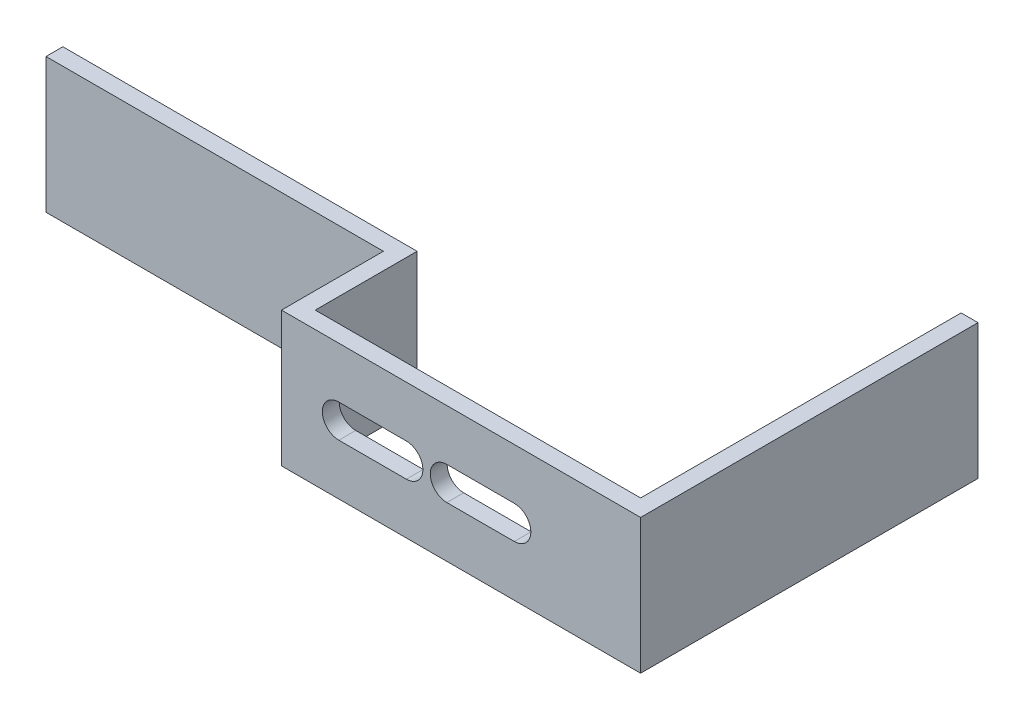
ISO-10303-21;
HEADER;
FILE_DESCRIPTION(('STEP AP214'),'2;1');
FILE_NAME('part.step','',(''),(''),'','','');
FILE_SCHEMA(('AUTOMOTIVE_DESIGN { 1 0 10303 214 1 1 1 1 }'));
ENDSEC;
DATA;
#1=APPLICATION_CONTEXT('core data for automotive mechanical design processes');
#2=APPLICATION_PROTOCOL_DEFINITION('international standard','automotive_design',2000,#1);
#3=PRODUCT_CONTEXT('',#1,'mechanical');
#4=PRODUCT('Part','Part','',(#3));
#5=PRODUCT_RELATED_PRODUCT_CATEGORY('part','',(#4));
#6=PRODUCT_DEFINITION_FORMATION('','',#4);
#7=PRODUCT_DEFINITION_CONTEXT('part definition',#1,'design');
#8=PRODUCT_DEFINITION('design','',#6,#7);
#9=PRODUCT_DEFINITION_SHAPE('','',#8);
#10=(LENGTH_UNIT() NAMED_UNIT(*) SI_UNIT(.MILLI.,.METRE.));
#11=(NAMED_UNIT(*) PLANE_ANGLE_UNIT() SI_UNIT($,.RADIAN.));
#12=(NAMED_UNIT(*) SI_UNIT($,.STERADIAN.) SOLID_ANGLE_UNIT());
#13=UNCERTAINTY_MEASURE_WITH_UNIT(LENGTH_MEASURE(1.E-05),#10,'distance_accuracy_value','');
#14=(GEOMETRIC_REPRESENTATION_CONTEXT(3) GLOBAL_UNCERTAINTY_ASSIGNED_CONTEXT((#13)) GLOBAL_UNIT_ASSIGNED_CONTEXT((#10,
#11,#12)) REPRESENTATION_CONTEXT('',''));
#15=CARTESIAN_POINT('',(0.,0.,0.));
#16=DIRECTION('',(0.,0.,1.));
#17=DIRECTION('',(1.,0.,0.));
#18=AXIS2_PLACEMENT_3D('',#15,#16,#17);
#19=CARTESIAN_POINT('',(0.,12.7,0.));
#20=DIRECTION('',(0.,0.,-1.));
#21=DIRECTION('',(-1.,0.,0.));
#22=AXIS2_PLACEMENT_3D('',#19,#20,#21);
#23=PLANE('',#22);
#24=DIRECTION('',(1.,0.,0.));
#25=VECTOR('',#24,1.);
#26=CARTESIAN_POINT('',(5.3975,4.79425,0.));
#27=LINE('',#26,#25);
#28=CARTESIAN_POINT('',(5.3975,4.79425,0.));
#29=VERTEX_POINT('',#28);
#30=CARTESIAN_POINT('',(11.7475,4.79425,0.));
#31=VERTEX_POINT('',#30);
#32=EDGE_CURVE('E186',#29,#31,#27,.T.);
#33=ORIENTED_EDGE('',*,*,#32,.F.);
#34=CARTESIAN_POINT('',(5.3975,6.35,0.));
#35=DIRECTION('',(0.,0.,1.));
#36=DIRECTION('',(1.,0.,0.));
#37=AXIS2_PLACEMENT_3D('',#34,#35,#36);
#38=CIRCLE('',#37,1.55575);
#39=CARTESIAN_POINT('',(5.3975,7.90575,0.));
#40=VERTEX_POINT('',#39);
#41=EDGE_CURVE('E58',#40,#29,#38,.T.);
#42=ORIENTED_EDGE('',*,*,#41,.F.);
#43=DIRECTION('',(-1.,0.,0.));
#44=VECTOR('',#43,1.);
#45=CARTESIAN_POINT('',(5.3975,7.90575,0.));
#46=LINE('',#45,#44);
#47=CARTESIAN_POINT('',(11.7475,7.90575,0.));
#48=VERTEX_POINT('',#47);
#49=EDGE_CURVE('E193',#48,#40,#46,.T.);
#50=ORIENTED_EDGE('',*,*,#49,.F.);
#51=CARTESIAN_POINT('',(11.7475,6.35,0.));
#52=DIRECTION('',(0.,0.,1.));
#53=DIRECTION('',(1.,0.,0.));
#54=AXIS2_PLACEMENT_3D('',#51,#52,#53);
#55=CIRCLE('',#54,1.55575);
#56=EDGE_CURVE('E175',#31,#48,#55,.T.);
#57=ORIENTED_EDGE('',*,*,#56,.F.);
#58=EDGE_LOOP('',(#33,#42,#50,#57));
#59=FACE_BOUND('',#58,.T.);
#60=DIRECTION('',(-1.,0.,0.));
#61=VECTOR('',#60,1.);
#62=CARTESIAN_POINT('',(21.9075,7.90575,0.));
#63=LINE('',#62,#61);
#64=CARTESIAN_POINT('',(21.9075,7.90575,0.));
#65=VERTEX_POINT('',#64);
#66=CARTESIAN_POINT('',(15.5575,7.90575,0.));
#67=VERTEX_POINT('',#66);
#68=EDGE_CURVE('E228',#65,#67,#63,.T.);
#69=ORIENTED_EDGE('',*,*,#68,.F.);
#70=CARTESIAN_POINT('',(21.9075,6.35,0.));
#71=DIRECTION('',(0.,0.,1.));
#72=DIRECTION('',(-1.,0.,0.));
#73=AXIS2_PLACEMENT_3D('',#70,#71,#72);
#74=CIRCLE('',#73,1.55575);
#75=CARTESIAN_POINT('',(21.9075,4.79425,0.));
#76=VERTEX_POINT('',#75);
#77=EDGE_CURVE('E66',#76,#65,#74,.T.);
#78=ORIENTED_EDGE('',*,*,#77,.F.);
#79=DIRECTION('',(1.,0.,0.));
#80=VECTOR('',#79,1.);
#81=CARTESIAN_POINT('',(21.9075,4.79425,0.));
#82=LINE('',#81,#80);
#83=CARTESIAN_POINT('',(15.5575,4.79425,0.));
#84=VERTEX_POINT('',#83);
#85=EDGE_CURVE('E211',#84,#76,#82,.T.);
#86=ORIENTED_EDGE('',*,*,#85,.F.);
#87=CARTESIAN_POINT('',(15.5575,6.35,0.));
#88=DIRECTION('',(0.,0.,1.));
#89=DIRECTION('',(-1.,0.,0.));
#90=AXIS2_PLACEMENT_3D('',#87,#88,#89);
#91=CIRCLE('',#90,1.55575);
#92=EDGE_CURVE('E224',#67,#84,#91,.T.);
#93=ORIENTED_EDGE('',*,*,#92,.F.);
#94=EDGE_LOOP('',(#69,#78,#86,#93));
#95=FACE_BOUND('',#94,.T.);
#96=DIRECTION('',(1.,0.,0.));
#97=VECTOR('',#96,1.);
#98=CARTESIAN_POINT('',(0.,0.,0.));
#99=LINE('',#98,#97);
#100=CARTESIAN_POINT('',(0.,0.,0.));
#101=VERTEX_POINT('',#100);
#102=CARTESIAN_POINT('',(33.7947,0.,0.));
#103=VERTEX_POINT('',#102);
#104=EDGE_CURVE('E203',#101,#103,#99,.T.);
#105=ORIENTED_EDGE('',*,*,#104,.T.);
#106=DIRECTION('',(0.,-1.,0.));
#107=VECTOR('',#106,1.);
#108=CARTESIAN_POINT('',(33.7947,12.7,0.));
#109=LINE('',#108,#107);
#110=CARTESIAN_POINT('',(33.7947,12.7,0.));
#111=VERTEX_POINT('',#110);
#112=EDGE_CURVE('E329',#111,#103,#109,.T.);
#113=ORIENTED_EDGE('',*,*,#112,.F.);
#114=DIRECTION('',(1.,0.,0.));
#115=VECTOR('',#114,1.);
#116=CARTESIAN_POINT('',(0.,12.7,0.));
#117=LINE('',#116,#115);
#118=CARTESIAN_POINT('',(0.,12.7,0.));
#119=VERTEX_POINT('',#118);
#120=EDGE_CURVE('E238',#119,#111,#117,.T.);
#121=ORIENTED_EDGE('',*,*,#120,.F.);
#122=DIRECTION('',(0.,-1.,0.));
#123=VECTOR('',#122,1.);
#124=CARTESIAN_POINT('',(0.,12.7,0.));
#125=LINE('',#124,#123);
#126=EDGE_CURVE('E333',#119,#101,#125,.T.);
#127=ORIENTED_EDGE('',*,*,#126,.T.);
#128=EDGE_LOOP('',(#105,#113,#121,#127));
#129=FACE_BOUND('',#128,.T.);
#130=ADVANCED_FACE('F43',(#59,#95,#129),#23,.F.);
#131=CARTESIAN_POINT('',(33.7947,12.7,-1.5875));
#132=DIRECTION('',(-1.,0.,0.));
#133=DIRECTION('',(0.,0.,1.));
#134=AXIS2_PLACEMENT_3D('',#131,#132,#133);
#135=PLANE('',#134);
#136=DIRECTION('',(0.,0.,-1.));
#137=VECTOR('',#136,1.);
#138=CARTESIAN_POINT('',(33.7947,0.,-1.5875));
#139=LINE('',#138,#137);
#140=CARTESIAN_POINT('',(33.7947,0.,-31.75));
#141=VERTEX_POINT('',#140);
#142=EDGE_CURVE('E271',#103,#141,#139,.T.);
#143=ORIENTED_EDGE('',*,*,#142,.T.);
#144=DIRECTION('',(0.,-1.,0.));
#145=VECTOR('',#144,1.);
#146=CARTESIAN_POINT('',(33.7947,12.7,-31.75));
#147=LINE('',#146,#145);
#148=CARTESIAN_POINT('',(33.7947,12.7,-31.75));
#149=VERTEX_POINT('',#148);
#150=EDGE_CURVE('E325',#149,#141,#147,.T.);
#151=ORIENTED_EDGE('',*,*,#150,.F.);
#152=DIRECTION('',(0.,0.,-1.));
#153=VECTOR('',#152,1.);
#154=CARTESIAN_POINT('',(33.7947,12.7,0.));
#155=LINE('',#154,#153);
#156=EDGE_CURVE('E242',#111,#149,#155,.T.);
#157=ORIENTED_EDGE('',*,*,#156,.F.);
#158=ORIENTED_EDGE('',*,*,#112,.T.);
#159=EDGE_LOOP('',(#143,#151,#157,#158));
#160=FACE_BOUND('',#159,.T.);
#161=ADVANCED_FACE('F380',(#160),#135,.F.);
#162=CARTESIAN_POINT('',(33.7947,12.7,-31.75));
#163=DIRECTION('',(0.,0.,1.));
#164=DIRECTION('',(1.,0.,0.));
#165=AXIS2_PLACEMENT_3D('',#162,#163,#164);
#166=PLANE('',#165);
#167=DIRECTION('',(-1.,0.,0.));
#168=VECTOR('',#167,1.);
#169=CARTESIAN_POINT('',(33.7947,0.,-31.75));
#170=LINE('',#169,#168);
#171=CARTESIAN_POINT('',(32.2072,0.,-31.75));
#172=VERTEX_POINT('',#171);
#173=EDGE_CURVE('E274',#141,#172,#170,.T.);
#174=ORIENTED_EDGE('',*,*,#173,.T.);
#175=DIRECTION('',(0.,-1.,0.));
#176=VECTOR('',#175,1.);
#177=CARTESIAN_POINT('',(32.2072,12.7,-31.75));
#178=LINE('',#177,#176);
#179=CARTESIAN_POINT('',(32.2072,12.7,-31.75));
#180=VERTEX_POINT('',#179);
#181=EDGE_CURVE('E321',#180,#172,#178,.T.);
#182=ORIENTED_EDGE('',*,*,#181,.F.);
#183=DIRECTION('',(-1.,0.,0.));
#184=VECTOR('',#183,1.);
#185=CARTESIAN_POINT('',(33.7947,12.7,-31.75));
#186=LINE('',#185,#184);
#187=EDGE_CURVE('E245',#149,#180,#186,.T.);
#188=ORIENTED_EDGE('',*,*,#187,.F.);
#189=ORIENTED_EDGE('',*,*,#150,.T.);
#190=EDGE_LOOP('',(#174,#182,#188,#189));
#191=FACE_BOUND('',#190,.T.);
#192=ADVANCED_FACE('F384',(#191),#166,.F.);
#193=CARTESIAN_POINT('',(32.2072,12.7,-1.5875));
#194=DIRECTION('',(1.,0.,0.));
#195=DIRECTION('',(0.,0.,-1.));
#196=AXIS2_PLACEMENT_3D('',#193,#194,#195);
#197=PLANE('',#196);
#198=DIRECTION('',(0.,0.,1.));
#199=VECTOR('',#198,1.);
#200=CARTESIAN_POINT('',(32.2072,0.,-1.5875));
#201=LINE('',#200,#199);
#202=CARTESIAN_POINT('',(32.2072,0.,-1.5875));
#203=VERTEX_POINT('',#202);
#204=EDGE_CURVE('E277',#172,#203,#201,.T.);
#205=ORIENTED_EDGE('',*,*,#204,.T.);
#206=DIRECTION('',(0.,-1.,0.));
#207=VECTOR('',#206,1.);
#208=CARTESIAN_POINT('',(32.2072,12.7,-1.5875));
#209=LINE('',#208,#207);
#210=CARTESIAN_POINT('',(32.2072,12.7,-1.5875));
#211=VERTEX_POINT('',#210);
#212=EDGE_CURVE('E317',#211,#203,#209,.T.);
#213=ORIENTED_EDGE('',*,*,#212,.F.);
#214=DIRECTION('',(0.,0.,1.));
#215=VECTOR('',#214,1.);
#216=CARTESIAN_POINT('',(32.2072,12.7,-1.5875));
#217=LINE('',#216,#215);
#218=EDGE_CURVE('E248',#180,#211,#217,.T.);
#219=ORIENTED_EDGE('',*,*,#218,.F.);
#220=ORIENTED_EDGE('',*,*,#181,.T.);
#221=EDGE_LOOP('',(#205,#213,#219,#220));
#222=FACE_BOUND('',#221,.T.);
#223=ADVANCED_FACE('F389',(#222),#197,.F.);
#224=CARTESIAN_POINT('',(1.5875,12.7,-1.5875));
#225=DIRECTION('',(0.,0.,1.));
#226=DIRECTION('',(1.,0.,0.));
#227=AXIS2_PLACEMENT_3D('',#224,#225,#226);
#228=PLANE('',#227);
#229=DIRECTION('',(-1.,0.,0.));
#230=VECTOR('',#229,1.);
#231=CARTESIAN_POINT('',(1.5875,7.90575,-1.5875));
#232=LINE('',#231,#230);
#233=CARTESIAN_POINT('',(11.7475,7.90575,-1.5875));
#234=VERTEX_POINT('',#233);
#235=CARTESIAN_POINT('',(5.3975,7.90575,-1.5875));
#236=VERTEX_POINT('',#235);
#237=EDGE_CURVE('E51',#234,#236,#232,.T.);
#238=ORIENTED_EDGE('',*,*,#237,.T.);
#239=CARTESIAN_POINT('',(5.3975,6.35,-1.5875));
#240=DIRECTION('',(0.,0.,1.));
#241=DIRECTION('',(1.,0.,0.));
#242=AXIS2_PLACEMENT_3D('',#239,#240,#241);
#243=CIRCLE('',#242,1.55575);
#244=CARTESIAN_POINT('',(5.3975,4.79425,-1.5875));
#245=VERTEX_POINT('',#244);
#246=EDGE_CURVE('E11',#236,#245,#243,.T.);
#247=ORIENTED_EDGE('',*,*,#246,.T.);
#248=DIRECTION('',(1.,0.,0.));
#249=VECTOR('',#248,1.);
#250=CARTESIAN_POINT('',(1.5875,4.79425,-1.5875));
#251=LINE('',#250,#249);
#252=CARTESIAN_POINT('',(11.7475,4.79425,-1.5875));
#253=VERTEX_POINT('',#252);
#254=EDGE_CURVE('E353',#245,#253,#251,.T.);
#255=ORIENTED_EDGE('',*,*,#254,.T.);
#256=CARTESIAN_POINT('',(11.7475,6.35,-1.5875));
#257=DIRECTION('',(0.,0.,1.));
#258=DIRECTION('',(1.,0.,0.));
#259=AXIS2_PLACEMENT_3D('',#256,#257,#258);
#260=CIRCLE('',#259,1.55575);
#261=EDGE_CURVE('E178',#253,#234,#260,.T.);
#262=ORIENTED_EDGE('',*,*,#261,.T.);
#263=EDGE_LOOP('',(#238,#247,#255,#262));
#264=FACE_BOUND('',#263,.T.);
#265=DIRECTION('',(1.,0.,0.));
#266=VECTOR('',#265,1.);
#267=CARTESIAN_POINT('',(1.5875,4.79425,-1.5875));
#268=LINE('',#267,#266);
#269=CARTESIAN_POINT('',(15.5575,4.79425,-1.5875));
#270=VERTEX_POINT('',#269);
#271=CARTESIAN_POINT('',(21.9075,4.79425,-1.5875));
#272=VERTEX_POINT('',#271);
#273=EDGE_CURVE('E345',#270,#272,#268,.T.);
#274=ORIENTED_EDGE('',*,*,#273,.T.);
#275=CARTESIAN_POINT('',(21.9075,6.35,-1.5875));
#276=DIRECTION('',(0.,0.,1.));
#277=DIRECTION('',(1.,0.,0.));
#278=AXIS2_PLACEMENT_3D('',#275,#276,#277);
#279=CIRCLE('',#278,1.55575);
#280=CARTESIAN_POINT('',(21.9075,7.90575,-1.5875));
#281=VERTEX_POINT('',#280);
#282=EDGE_CURVE('E349',#272,#281,#279,.T.);
#283=ORIENTED_EDGE('',*,*,#282,.T.);
#284=DIRECTION('',(-1.,0.,0.));
#285=VECTOR('',#284,1.);
#286=CARTESIAN_POINT('',(1.5875,7.90575,-1.5875));
#287=LINE('',#286,#285);
#288=CARTESIAN_POINT('',(15.5575,7.90575,-1.5875));
#289=VERTEX_POINT('',#288);
#290=EDGE_CURVE('E337',#281,#289,#287,.T.);
#291=ORIENTED_EDGE('',*,*,#290,.T.);
#292=CARTESIAN_POINT('',(15.5575,6.35,-1.5875));
#293=DIRECTION('',(0.,0.,1.));
#294=DIRECTION('',(1.,0.,0.));
#295=AXIS2_PLACEMENT_3D('',#292,#293,#294);
#296=CIRCLE('',#295,1.55575);
#297=EDGE_CURVE('E341',#289,#270,#296,.T.);
#298=ORIENTED_EDGE('',*,*,#297,.T.);
#299=EDGE_LOOP('',(#274,#283,#291,#298));
#300=FACE_BOUND('',#299,.T.);
#301=DIRECTION('',(-1.,0.,0.));
#302=VECTOR('',#301,1.);
#303=CARTESIAN_POINT('',(1.5875,0.,-1.5875));
#304=LINE('',#303,#302);
#305=CARTESIAN_POINT('',(1.5875,0.,-1.5875));
#306=VERTEX_POINT('',#305);
#307=EDGE_CURVE('E280',#203,#306,#304,.T.);
#308=ORIENTED_EDGE('',*,*,#307,.T.);
#309=DIRECTION('',(0.,-1.,0.));
#310=VECTOR('',#309,1.);
#311=CARTESIAN_POINT('',(1.5875,12.7,-1.5875));
#312=LINE('',#311,#310);
#313=CARTESIAN_POINT('',(1.5875,12.7,-1.5875));
#314=VERTEX_POINT('',#313);
#315=EDGE_CURVE('E313',#314,#306,#312,.T.);
#316=ORIENTED_EDGE('',*,*,#315,.F.);
#317=DIRECTION('',(-1.,0.,0.));
#318=VECTOR('',#317,1.);
#319=CARTESIAN_POINT('',(1.5875,12.7,-1.5875));
#320=LINE('',#319,#318);
#321=EDGE_CURVE('E251',#211,#314,#320,.T.);
#322=ORIENTED_EDGE('',*,*,#321,.F.);
#323=ORIENTED_EDGE('',*,*,#212,.T.);
#324=EDGE_LOOP('',(#308,#316,#322,#323));
#325=FACE_BOUND('',#324,.T.);
#326=ADVANCED_FACE('F360',(#264,#300,#325),#228,.F.);
#327=CARTESIAN_POINT('',(1.5875,12.7,-1.5875));
#328=DIRECTION('',(-1.,0.,0.));
#329=DIRECTION('',(0.,0.,1.));
#330=AXIS2_PLACEMENT_3D('',#327,#328,#329);
#331=PLANE('',#330);
#332=DIRECTION('',(0.,0.,-1.));
#333=VECTOR('',#332,1.);
#334=CARTESIAN_POINT('',(1.5875,0.,-1.5875));
#335=LINE('',#334,#333);
#336=CARTESIAN_POINT('',(1.5875,0.,-11.176));
#337=VERTEX_POINT('',#336);
#338=EDGE_CURVE('E283',#306,#337,#335,.T.);
#339=ORIENTED_EDGE('',*,*,#338,.T.);
#340=DIRECTION('',(0.,-1.,0.));
#341=VECTOR('',#340,1.);
#342=CARTESIAN_POINT('',(1.5875,12.7,-11.176));
#343=LINE('',#342,#341);
#344=CARTESIAN_POINT('',(1.5875,12.7,-11.176));
#345=VERTEX_POINT('',#344);
#346=EDGE_CURVE('E309',#345,#337,#343,.T.);
#347=ORIENTED_EDGE('',*,*,#346,.F.);
#348=DIRECTION('',(0.,0.,-1.));
#349=VECTOR('',#348,1.);
#350=CARTESIAN_POINT('',(1.5875,12.7,-1.5875));
#351=LINE('',#350,#349);
#352=EDGE_CURVE('E254',#314,#345,#351,.T.);
#353=ORIENTED_EDGE('',*,*,#352,.F.);
#354=ORIENTED_EDGE('',*,*,#315,.T.);
#355=EDGE_LOOP('',(#339,#347,#353,#354));
#356=FACE_BOUND('',#355,.T.);
#357=ADVANCED_FACE('F398',(#356),#331,.F.);
#358=CARTESIAN_POINT('',(0.,12.7,-11.176));
#359=DIRECTION('',(0.,0.,1.));
#360=DIRECTION('',(1.,0.,0.));
#361=AXIS2_PLACEMENT_3D('',#358,#359,#360);
#362=PLANE('',#361);
#363=DIRECTION('',(-1.,0.,0.));
#364=VECTOR('',#363,1.);
#365=CARTESIAN_POINT('',(0.,0.,-11.176));
#366=LINE('',#365,#364);
#367=CARTESIAN_POINT('',(-31.75,0.,-11.176));
#368=VERTEX_POINT('',#367);
#369=EDGE_CURVE('E287',#337,#368,#366,.T.);
#370=ORIENTED_EDGE('',*,*,#369,.T.);
#371=DIRECTION('',(0.,-1.,0.));
#372=VECTOR('',#371,1.);
#373=CARTESIAN_POINT('',(-31.75,12.7,-11.176));
#374=LINE('',#373,#372);
#375=CARTESIAN_POINT('',(-31.75,12.7,-11.176));
#376=VERTEX_POINT('',#375);
#377=EDGE_CURVE('E305',#376,#368,#374,.T.);
#378=ORIENTED_EDGE('',*,*,#377,.F.);
#379=DIRECTION('',(-1.,0.,0.));
#380=VECTOR('',#379,1.);
#381=CARTESIAN_POINT('',(0.,12.7,-11.176));
#382=LINE('',#381,#380);
#383=EDGE_CURVE('E257',#345,#376,#382,.T.);
#384=ORIENTED_EDGE('',*,*,#383,.F.);
#385=ORIENTED_EDGE('',*,*,#346,.T.);
#386=EDGE_LOOP('',(#370,#378,#384,#385));
#387=FACE_BOUND('',#386,.T.);
#388=ADVANCED_FACE('F401',(#387),#362,.F.);
#389=CARTESIAN_POINT('',(-31.75,12.7,-11.176));
#390=DIRECTION('',(1.,0.,0.));
#391=DIRECTION('',(0.,0.,-1.));
#392=AXIS2_PLACEMENT_3D('',#389,#390,#391);
#393=PLANE('',#392);
#394=DIRECTION('',(0.,0.,1.));
#395=VECTOR('',#394,1.);
#396=CARTESIAN_POINT('',(-31.75,0.,-11.176));
#397=LINE('',#396,#395);
#398=CARTESIAN_POINT('',(-31.75,0.,-9.5885));
#399=VERTEX_POINT('',#398);
#400=EDGE_CURVE('E290',#368,#399,#397,.T.);
#401=ORIENTED_EDGE('',*,*,#400,.T.);
#402=DIRECTION('',(0.,-1.,0.));
#403=VECTOR('',#402,1.);
#404=CARTESIAN_POINT('',(-31.75,12.7,-9.5885));
#405=LINE('',#404,#403);
#406=CARTESIAN_POINT('',(-31.75,12.7,-9.5885));
#407=VERTEX_POINT('',#406);
#408=EDGE_CURVE('E301',#407,#399,#405,.T.);
#409=ORIENTED_EDGE('',*,*,#408,.F.);
#410=DIRECTION('',(0.,0.,1.));
#411=VECTOR('',#410,1.);
#412=CARTESIAN_POINT('',(-31.75,12.7,-11.176));
#413=LINE('',#412,#411);
#414=EDGE_CURVE('E260',#376,#407,#413,.T.);
#415=ORIENTED_EDGE('',*,*,#414,.F.);
#416=ORIENTED_EDGE('',*,*,#377,.T.);
#417=EDGE_LOOP('',(#401,#409,#415,#416));
#418=FACE_BOUND('',#417,.T.);
#419=ADVANCED_FACE('F405',(#418),#393,.F.);
#420=CARTESIAN_POINT('',(0.,12.7,-9.5885));
#421=DIRECTION('',(0.,0.,-1.));
#422=DIRECTION('',(-1.,0.,0.));
#423=AXIS2_PLACEMENT_3D('',#420,#421,#422);
#424=PLANE('',#423);
#425=DIRECTION('',(1.,0.,0.));
#426=VECTOR('',#425,1.);
#427=CARTESIAN_POINT('',(0.,0.,-9.5885));
#428=LINE('',#427,#426);
#429=CARTESIAN_POINT('',(0.,0.,-9.5885));
#430=VERTEX_POINT('',#429);
#431=EDGE_CURVE('E293',#399,#430,#428,.T.);
#432=ORIENTED_EDGE('',*,*,#431,.T.);
#433=DIRECTION('',(0.,-1.,0.));
#434=VECTOR('',#433,1.);
#435=CARTESIAN_POINT('',(0.,12.7,-9.5885));
#436=LINE('',#435,#434);
#437=CARTESIAN_POINT('',(0.,12.7,-9.5885));
#438=VERTEX_POINT('',#437);
#439=EDGE_CURVE('E267',#438,#430,#436,.T.);
#440=ORIENTED_EDGE('',*,*,#439,.F.);
#441=DIRECTION('',(1.,0.,0.));
#442=VECTOR('',#441,1.);
#443=CARTESIAN_POINT('',(0.,12.7,-9.5885));
#444=LINE('',#443,#442);
#445=EDGE_CURVE('E263',#407,#438,#444,.T.);
#446=ORIENTED_EDGE('',*,*,#445,.F.);
#447=ORIENTED_EDGE('',*,*,#408,.T.);
#448=EDGE_LOOP('',(#432,#440,#446,#447));
#449=FACE_BOUND('',#448,.T.);
#450=ADVANCED_FACE('F409',(#449),#424,.F.);
#451=CARTESIAN_POINT('',(0.,12.7,-1.5875));
#452=DIRECTION('',(1.,0.,0.));
#453=DIRECTION('',(0.,0.,-1.));
#454=AXIS2_PLACEMENT_3D('',#451,#452,#453);
#455=PLANE('',#454);
#456=DIRECTION('',(0.,0.,1.));
#457=VECTOR('',#456,1.);
#458=CARTESIAN_POINT('',(0.,0.,-1.5875));
#459=LINE('',#458,#457);
#460=EDGE_CURVE('E239',#430,#101,#459,.T.);
#461=ORIENTED_EDGE('',*,*,#460,.T.);
#462=ORIENTED_EDGE('',*,*,#126,.F.);
#463=DIRECTION('',(0.,0.,1.));
#464=VECTOR('',#463,1.);
#465=CARTESIAN_POINT('',(0.,12.7,0.));
#466=LINE('',#465,#464);
#467=EDGE_CURVE('E234',#438,#119,#466,.T.);
#468=ORIENTED_EDGE('',*,*,#467,.F.);
#469=ORIENTED_EDGE('',*,*,#439,.T.);
#470=EDGE_LOOP('',(#461,#462,#468,#469));
#471=FACE_BOUND('',#470,.T.);
#472=ADVANCED_FACE('F413',(#471),#455,.F.);
#473=CARTESIAN_POINT('',(0.,12.7,0.));
#474=DIRECTION('',(0.,1.,0.));
#475=DIRECTION('',(0.,0.,1.));
#476=AXIS2_PLACEMENT_3D('',#473,#474,#475);
#477=PLANE('',#476);
#478=ORIENTED_EDGE('',*,*,#467,.T.);
#479=ORIENTED_EDGE('',*,*,#120,.T.);
#480=ORIENTED_EDGE('',*,*,#156,.T.);
#481=ORIENTED_EDGE('',*,*,#187,.T.);
#482=ORIENTED_EDGE('',*,*,#218,.T.);
#483=ORIENTED_EDGE('',*,*,#321,.T.);
#484=ORIENTED_EDGE('',*,*,#352,.T.);
#485=ORIENTED_EDGE('',*,*,#383,.T.);
#486=ORIENTED_EDGE('',*,*,#414,.T.);
#487=ORIENTED_EDGE('',*,*,#445,.T.);
#488=EDGE_LOOP('',(#478,#479,#480,#481,#482,#483,#484,#485,#486,#487));
#489=FACE_BOUND('',#488,.T.);
#490=ADVANCED_FACE('F417',(#489),#477,.T.);
#491=CARTESIAN_POINT('',(0.,0.,0.));
#492=DIRECTION('',(0.,1.,0.));
#493=DIRECTION('',(0.,0.,1.));
#494=AXIS2_PLACEMENT_3D('',#491,#492,#493);
#495=PLANE('',#494);
#496=ORIENTED_EDGE('',*,*,#104,.F.);
#497=ORIENTED_EDGE('',*,*,#460,.F.);
#498=ORIENTED_EDGE('',*,*,#431,.F.);
#499=ORIENTED_EDGE('',*,*,#400,.F.);
#500=ORIENTED_EDGE('',*,*,#369,.F.);
#501=ORIENTED_EDGE('',*,*,#338,.F.);
#502=ORIENTED_EDGE('',*,*,#307,.F.);
#503=ORIENTED_EDGE('',*,*,#204,.F.);
#504=ORIENTED_EDGE('',*,*,#173,.F.);
#505=ORIENTED_EDGE('',*,*,#142,.F.);
#506=EDGE_LOOP('',(#496,#497,#498,#499,#500,#501,#502,#503,#504,#505));
#507=FACE_BOUND('',#506,.T.);
#508=ADVANCED_FACE('F419',(#507),#495,.F.);
#509=CARTESIAN_POINT('',(21.9075,6.35,-31.75));
#510=DIRECTION('',(0.,0.,1.));
#511=DIRECTION('',(1.,0.,0.));
#512=AXIS2_PLACEMENT_3D('',#509,#510,#511);
#513=CYLINDRICAL_SURFACE('',#512,1.55575);
#514=DIRECTION('',(0.,0.,1.));
#515=VECTOR('',#514,1.);
#516=CARTESIAN_POINT('',(21.9075,4.79425,-31.75));
#517=LINE('',#516,#515);
#518=EDGE_CURVE('E218',#272,#76,#517,.T.);
#519=ORIENTED_EDGE('',*,*,#518,.T.);
#520=ORIENTED_EDGE('',*,*,#77,.T.);
#521=DIRECTION('',(0.,0.,1.));
#522=VECTOR('',#521,1.);
#523=CARTESIAN_POINT('',(21.9075,7.90575,-31.75));
#524=LINE('',#523,#522);
#525=EDGE_CURVE('E208',#281,#65,#524,.T.);
#526=ORIENTED_EDGE('',*,*,#525,.F.);
#527=ORIENTED_EDGE('',*,*,#282,.F.);
#528=EDGE_LOOP('',(#519,#520,#526,#527));
#529=FACE_BOUND('',#528,.T.);
#530=ADVANCED_FACE('F422',(#529),#513,.F.);
#531=CARTESIAN_POINT('',(21.9075,4.79425,-31.75));
#532=DIRECTION('',(0.,-1.,0.));
#533=DIRECTION('',(0.,0.,-1.));
#534=AXIS2_PLACEMENT_3D('',#531,#532,#533);
#535=PLANE('',#534);
#536=DIRECTION('',(0.,0.,1.));
#537=VECTOR('',#536,1.);
#538=CARTESIAN_POINT('',(15.5575,4.79425,-31.75));
#539=LINE('',#538,#537);
#540=EDGE_CURVE('E215',#270,#84,#539,.T.);
#541=ORIENTED_EDGE('',*,*,#540,.T.);
#542=ORIENTED_EDGE('',*,*,#85,.T.);
#543=ORIENTED_EDGE('',*,*,#518,.F.);
#544=ORIENTED_EDGE('',*,*,#273,.F.);
#545=EDGE_LOOP('',(#541,#542,#543,#544));
#546=FACE_BOUND('',#545,.T.);
#547=ADVANCED_FACE('F427',(#546),#535,.F.);
#548=CARTESIAN_POINT('',(15.5575,6.35,-31.75));
#549=DIRECTION('',(0.,0.,1.));
#550=DIRECTION('',(1.,0.,0.));
#551=AXIS2_PLACEMENT_3D('',#548,#549,#550);
#552=CYLINDRICAL_SURFACE('',#551,1.55575);
#553=DIRECTION('',(0.,0.,1.));
#554=VECTOR('',#553,1.);
#555=CARTESIAN_POINT('',(15.5575,7.90575,-31.75));
#556=LINE('',#555,#554);
#557=EDGE_CURVE('E212',#289,#67,#556,.T.);
#558=ORIENTED_EDGE('',*,*,#557,.T.);
#559=ORIENTED_EDGE('',*,*,#92,.T.);
#560=ORIENTED_EDGE('',*,*,#540,.F.);
#561=ORIENTED_EDGE('',*,*,#297,.F.);
#562=EDGE_LOOP('',(#558,#559,#560,#561));
#563=FACE_BOUND('',#562,.T.);
#564=ADVANCED_FACE('F374',(#563),#552,.F.);
#565=CARTESIAN_POINT('',(21.9075,7.90575,-31.75));
#566=DIRECTION('',(0.,1.,0.));
#567=DIRECTION('',(0.,0.,1.));
#568=AXIS2_PLACEMENT_3D('',#565,#566,#567);
#569=PLANE('',#568);
#570=ORIENTED_EDGE('',*,*,#525,.T.);
#571=ORIENTED_EDGE('',*,*,#68,.T.);
#572=ORIENTED_EDGE('',*,*,#557,.F.);
#573=ORIENTED_EDGE('',*,*,#290,.F.);
#574=EDGE_LOOP('',(#570,#571,#572,#573));
#575=FACE_BOUND('',#574,.T.);
#576=ADVANCED_FACE('F367',(#575),#569,.F.);
#577=CARTESIAN_POINT('',(5.3975,6.35,-31.75));
#578=DIRECTION('',(0.,0.,1.));
#579=DIRECTION('',(1.,0.,0.));
#580=AXIS2_PLACEMENT_3D('',#577,#578,#579);
#581=CYLINDRICAL_SURFACE('',#580,1.55575);
#582=DIRECTION('',(0.,0.,1.));
#583=VECTOR('',#582,1.);
#584=CARTESIAN_POINT('',(5.3975,7.90575,-31.75));
#585=LINE('',#584,#583);
#586=EDGE_CURVE('E200',#236,#40,#585,.T.);
#587=ORIENTED_EDGE('',*,*,#586,.T.);
#588=ORIENTED_EDGE('',*,*,#41,.T.);
#589=DIRECTION('',(0.,0.,1.));
#590=VECTOR('',#589,1.);
#591=CARTESIAN_POINT('',(5.3975,4.79425,-31.75));
#592=LINE('',#591,#590);
#593=EDGE_CURVE('E183',#245,#29,#592,.T.);
#594=ORIENTED_EDGE('',*,*,#593,.F.);
#595=ORIENTED_EDGE('',*,*,#246,.F.);
#596=EDGE_LOOP('',(#587,#588,#594,#595));
#597=FACE_BOUND('',#596,.T.);
#598=ADVANCED_FACE('F365',(#597),#581,.F.);
#599=CARTESIAN_POINT('',(5.3975,7.90575,-31.75));
#600=DIRECTION('',(0.,1.,0.));
#601=DIRECTION('',(-1.,0.,0.));
#602=AXIS2_PLACEMENT_3D('',#599,#600,#601);
#603=PLANE('',#602);
#604=DIRECTION('',(0.,0.,1.));
#605=VECTOR('',#604,1.);
#606=CARTESIAN_POINT('',(11.7475,7.90575,-31.75));
#607=LINE('',#606,#605);
#608=EDGE_CURVE('E182',#234,#48,#607,.T.);
#609=ORIENTED_EDGE('',*,*,#608,.T.);
#610=ORIENTED_EDGE('',*,*,#49,.T.);
#611=ORIENTED_EDGE('',*,*,#586,.F.);
#612=ORIENTED_EDGE('',*,*,#237,.F.);
#613=EDGE_LOOP('',(#609,#610,#611,#612));
#614=FACE_BOUND('',#613,.T.);
#615=ADVANCED_FACE('F364',(#614),#603,.F.);
#616=CARTESIAN_POINT('',(11.7475,6.35,-31.75));
#617=DIRECTION('',(0.,0.,1.));
#618=DIRECTION('',(1.,0.,0.));
#619=AXIS2_PLACEMENT_3D('',#616,#617,#618);
#620=CYLINDRICAL_SURFACE('',#619,1.55575);
#621=DIRECTION('',(0.,0.,1.));
#622=VECTOR('',#621,1.);
#623=CARTESIAN_POINT('',(11.7475,4.79425,-31.75));
#624=LINE('',#623,#622);
#625=EDGE_CURVE('E170',#253,#31,#624,.T.);
#626=ORIENTED_EDGE('',*,*,#625,.T.);
#627=ORIENTED_EDGE('',*,*,#56,.T.);
#628=ORIENTED_EDGE('',*,*,#608,.F.);
#629=ORIENTED_EDGE('',*,*,#261,.F.);
#630=EDGE_LOOP('',(#626,#627,#628,#629));
#631=FACE_BOUND('',#630,.T.);
#632=ADVANCED_FACE('F172',(#631),#620,.F.);
#633=CARTESIAN_POINT('',(5.3975,4.79425,-31.75));
#634=DIRECTION('',(0.,-1.,0.));
#635=DIRECTION('',(1.,0.,0.));
#636=AXIS2_PLACEMENT_3D('',#633,#634,#635);
#637=PLANE('',#636);
#638=ORIENTED_EDGE('',*,*,#593,.T.);
#639=ORIENTED_EDGE('',*,*,#32,.T.);
#640=ORIENTED_EDGE('',*,*,#625,.F.);
#641=ORIENTED_EDGE('',*,*,#254,.F.);
#642=EDGE_LOOP('',(#638,#639,#640,#641));
#643=FACE_BOUND('',#642,.T.);
#644=ADVANCED_FACE('F187',(#643),#637,.F.);
#645=CLOSED_SHELL('',(#130,#161,#192,#223,#326,#357,#388,#419,#450,#472,#490,#508,#530,#547,
#564,#576,#598,#615,#632,#644));
#646=MANIFOLD_SOLID_BREP('B2',#645);
#647=ADVANCED_BREP_SHAPE_REPRESENTATION('',(#18,#646),#14);
#648=SHAPE_DEFINITION_REPRESENTATION(#9,#647);
ENDSEC;
END-ISO-10303-21;
